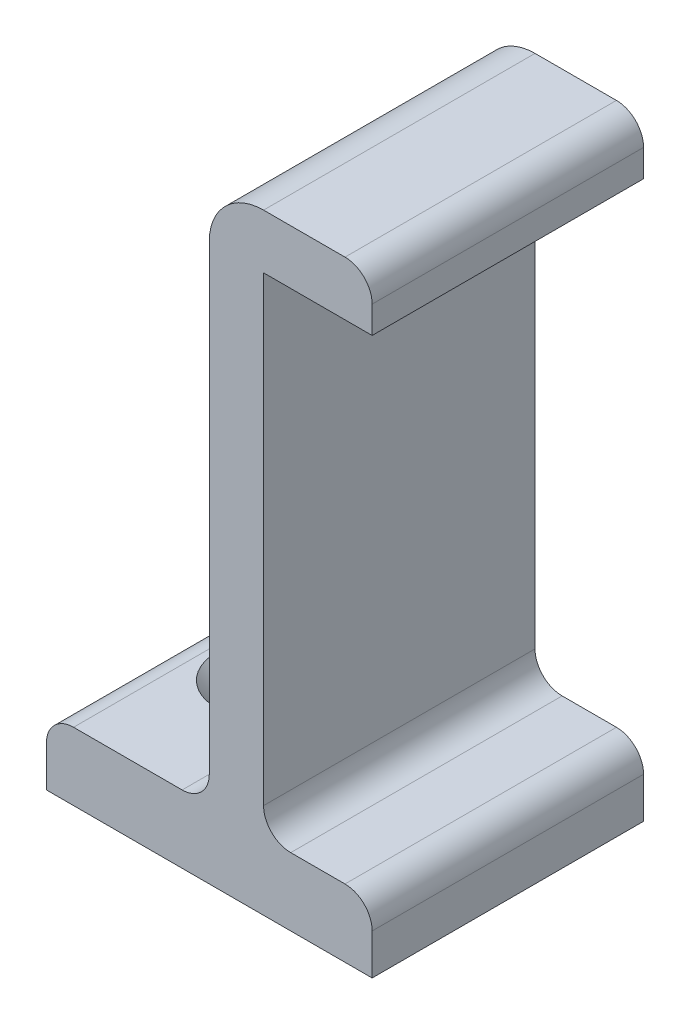
ISO-10303-21;
HEADER;
FILE_DESCRIPTION(('STEP AP214'),'2;1');
FILE_NAME('part.step','',(''),(''),'','','');
FILE_SCHEMA(('AUTOMOTIVE_DESIGN { 1 0 10303 214 1 1 1 1 }'));
ENDSEC;
DATA;
#1=APPLICATION_CONTEXT('core data for automotive mechanical design processes');
#2=APPLICATION_PROTOCOL_DEFINITION('international standard','automotive_design',2000,#1);
#3=PRODUCT_CONTEXT('',#1,'mechanical');
#4=PRODUCT('Part','Part','',(#3));
#5=PRODUCT_RELATED_PRODUCT_CATEGORY('part','',(#4));
#6=PRODUCT_DEFINITION_FORMATION('','',#4);
#7=PRODUCT_DEFINITION_CONTEXT('part definition',#1,'design');
#8=PRODUCT_DEFINITION('design','',#6,#7);
#9=PRODUCT_DEFINITION_SHAPE('','',#8);
#10=(LENGTH_UNIT() NAMED_UNIT(*) SI_UNIT(.MILLI.,.METRE.));
#11=(NAMED_UNIT(*) PLANE_ANGLE_UNIT() SI_UNIT($,.RADIAN.));
#12=(NAMED_UNIT(*) SI_UNIT($,.STERADIAN.) SOLID_ANGLE_UNIT());
#13=UNCERTAINTY_MEASURE_WITH_UNIT(LENGTH_MEASURE(1.E-05),#10,'distance_accuracy_value','');
#14=(GEOMETRIC_REPRESENTATION_CONTEXT(3) GLOBAL_UNCERTAINTY_ASSIGNED_CONTEXT((#13)) GLOBAL_UNIT_ASSIGNED_CONTEXT((#10,
#11,#12)) REPRESENTATION_CONTEXT('',''));
#15=CARTESIAN_POINT('',(0.,0.,0.));
#16=DIRECTION('',(0.,0.,1.));
#17=DIRECTION('',(1.,0.,0.));
#18=AXIS2_PLACEMENT_3D('',#15,#16,#17);
#19=CARTESIAN_POINT('',(-24.,0.,10.));
#20=DIRECTION('',(1.,0.,0.));
#21=DIRECTION('',(0.,0.,-1.));
#22=AXIS2_PLACEMENT_3D('',#19,#20,#21);
#23=PLANE('',#22);
#24=DIRECTION('',(0.,-1.,0.));
#25=VECTOR('',#24,1.);
#26=CARTESIAN_POINT('',(-24.,0.,10.));
#27=LINE('',#26,#25);
#28=CARTESIAN_POINT('',(-24.,3.,10.));
#29=VERTEX_POINT('',#28);
#30=CARTESIAN_POINT('',(-24.,0.,10.));
#31=VERTEX_POINT('',#30);
#32=EDGE_CURVE('E146',#29,#31,#27,.T.);
#33=ORIENTED_EDGE('',*,*,#32,.F.);
#34=DIRECTION('',(0.,0.,-1.));
#35=VECTOR('',#34,1.);
#36=CARTESIAN_POINT('',(-24.,3.,10.));
#37=LINE('',#36,#35);
#38=CARTESIAN_POINT('',(-24.,3.,-10.));
#39=VERTEX_POINT('',#38);
#40=EDGE_CURVE('E202',#29,#39,#37,.T.);
#41=ORIENTED_EDGE('',*,*,#40,.T.);
#42=DIRECTION('',(0.,-1.,0.));
#43=VECTOR('',#42,1.);
#44=CARTESIAN_POINT('',(-24.,0.,-10.));
#45=LINE('',#44,#43);
#46=CARTESIAN_POINT('',(-24.,0.,-10.));
#47=VERTEX_POINT('',#46);
#48=EDGE_CURVE('E171',#39,#47,#45,.T.);
#49=ORIENTED_EDGE('',*,*,#48,.T.);
#50=DIRECTION('',(0.,0.,-1.));
#51=VECTOR('',#50,1.);
#52=CARTESIAN_POINT('',(-24.,0.,10.));
#53=LINE('',#52,#51);
#54=EDGE_CURVE('E164',#31,#47,#53,.T.);
#55=ORIENTED_EDGE('',*,*,#54,.F.);
#56=EDGE_LOOP('',(#33,#41,#49,#55));
#57=FACE_BOUND('',#56,.T.);
#58=ADVANCED_FACE('F34',(#57),#23,.F.);
#59=CARTESIAN_POINT('',(-24.,0.,10.));
#60=DIRECTION('',(0.,1.,0.));
#61=DIRECTION('',(0.,0.,1.));
#62=AXIS2_PLACEMENT_3D('',#59,#60,#61);
#63=PLANE('',#62);
#64=CARTESIAN_POINT('',(-18.,0.,0.));
#65=DIRECTION('',(0.,1.,0.));
#66=DIRECTION('',(-1.,0.,0.));
#67=AXIS2_PLACEMENT_3D('',#64,#65,#66);
#68=CIRCLE('',#67,1.5);
#69=CARTESIAN_POINT('',(-19.5,0.,0.));
#70=VERTEX_POINT('',#69);
#71=EDGE_CURVE('E281',#70,#70,#68,.T.);
#72=ORIENTED_EDGE('',*,*,#71,.T.);
#73=EDGE_LOOP('',(#72));
#74=FACE_BOUND('',#73,.T.);
#75=DIRECTION('',(1.,0.,0.));
#76=VECTOR('',#75,1.);
#77=CARTESIAN_POINT('',(-24.,0.,-10.));
#78=LINE('',#77,#76);
#79=CARTESIAN_POINT('',(0.,0.,-10.));
#80=VERTEX_POINT('',#79);
#81=EDGE_CURVE('E278',#47,#80,#78,.T.);
#82=ORIENTED_EDGE('',*,*,#81,.T.);
#83=DIRECTION('',(0.,0.,-1.));
#84=VECTOR('',#83,1.);
#85=CARTESIAN_POINT('',(0.,0.,10.));
#86=LINE('',#85,#84);
#87=CARTESIAN_POINT('',(0.,0.,10.));
#88=VERTEX_POINT('',#87);
#89=EDGE_CURVE('E166',#88,#80,#86,.T.);
#90=ORIENTED_EDGE('',*,*,#89,.F.);
#91=DIRECTION('',(1.,0.,0.));
#92=VECTOR('',#91,1.);
#93=CARTESIAN_POINT('',(-24.,0.,10.));
#94=LINE('',#93,#92);
#95=EDGE_CURVE('E150',#31,#88,#94,.T.);
#96=ORIENTED_EDGE('',*,*,#95,.F.);
#97=ORIENTED_EDGE('',*,*,#54,.T.);
#98=EDGE_LOOP('',(#82,#90,#96,#97));
#99=FACE_BOUND('',#98,.T.);
#100=ADVANCED_FACE('F163',(#74,#99),#63,.F.);
#101=CARTESIAN_POINT('',(0.,5.,10.));
#102=DIRECTION('',(-1.,0.,0.));
#103=DIRECTION('',(0.,-1.,0.));
#104=AXIS2_PLACEMENT_3D('',#101,#102,#103);
#105=PLANE('',#104);
#106=DIRECTION('',(0.,1.,0.));
#107=VECTOR('',#106,1.);
#108=CARTESIAN_POINT('',(0.,5.,-10.));
#109=LINE('',#108,#107);
#110=CARTESIAN_POINT('',(0.,3.,-10.));
#111=VERTEX_POINT('',#110);
#112=EDGE_CURVE('E275',#80,#111,#109,.T.);
#113=ORIENTED_EDGE('',*,*,#112,.T.);
#114=DIRECTION('',(0.,0.,-1.));
#115=VECTOR('',#114,1.);
#116=CARTESIAN_POINT('',(0.,3.,10.));
#117=LINE('',#116,#115);
#118=CARTESIAN_POINT('',(0.,3.,10.));
#119=VERTEX_POINT('',#118);
#120=EDGE_CURVE('E195',#111,#119,#117,.F.);
#121=ORIENTED_EDGE('',*,*,#120,.T.);
#122=DIRECTION('',(0.,1.,0.));
#123=VECTOR('',#122,1.);
#124=CARTESIAN_POINT('',(0.,5.,10.));
#125=LINE('',#124,#123);
#126=EDGE_CURVE('E168',#88,#119,#125,.T.);
#127=ORIENTED_EDGE('',*,*,#126,.F.);
#128=ORIENTED_EDGE('',*,*,#89,.T.);
#129=EDGE_LOOP('',(#113,#121,#127,#128));
#130=FACE_BOUND('',#129,.T.);
#131=ADVANCED_FACE('F319',(#130),#105,.F.);
#132=CARTESIAN_POINT('',(-8.,5.,10.));
#133=DIRECTION('',(0.,-1.,0.));
#134=DIRECTION('',(0.,0.,-1.));
#135=AXIS2_PLACEMENT_3D('',#132,#133,#134);
#136=PLANE('',#135);
#137=DIRECTION('',(-1.,0.,0.));
#138=VECTOR('',#137,1.);
#139=CARTESIAN_POINT('',(-8.,5.,10.));
#140=LINE('',#139,#138);
#141=CARTESIAN_POINT('',(-2.,5.,10.));
#142=VERTEX_POINT('',#141);
#143=CARTESIAN_POINT('',(-6.,5.,10.));
#144=VERTEX_POINT('',#143);
#145=EDGE_CURVE('E292',#142,#144,#140,.T.);
#146=ORIENTED_EDGE('',*,*,#145,.F.);
#147=DIRECTION('',(0.,0.,-1.));
#148=VECTOR('',#147,1.);
#149=CARTESIAN_POINT('',(-2.,5.,10.));
#150=LINE('',#149,#148);
#151=CARTESIAN_POINT('',(-2.,5.,-10.));
#152=VERTEX_POINT('',#151);
#153=EDGE_CURVE('E186',#142,#152,#150,.T.);
#154=ORIENTED_EDGE('',*,*,#153,.T.);
#155=DIRECTION('',(-1.,0.,0.));
#156=VECTOR('',#155,1.);
#157=CARTESIAN_POINT('',(-8.,5.,-10.));
#158=LINE('',#157,#156);
#159=CARTESIAN_POINT('',(-6.,5.,-10.));
#160=VERTEX_POINT('',#159);
#161=EDGE_CURVE('E270',#152,#160,#158,.T.);
#162=ORIENTED_EDGE('',*,*,#161,.T.);
#163=DIRECTION('',(0.,0.,-1.));
#164=VECTOR('',#163,1.);
#165=CARTESIAN_POINT('',(-6.,5.,10.));
#166=LINE('',#165,#164);
#167=EDGE_CURVE('E184',#160,#144,#166,.F.);
#168=ORIENTED_EDGE('',*,*,#167,.T.);
#169=EDGE_LOOP('',(#146,#154,#162,#168));
#170=FACE_BOUND('',#169,.T.);
#171=ADVANCED_FACE('F357',(#170),#136,.F.);
#172=CARTESIAN_POINT('',(-8.,41.,10.));
#173=DIRECTION('',(-1.,0.,0.));
#174=DIRECTION('',(0.,-1.,0.));
#175=AXIS2_PLACEMENT_3D('',#172,#173,#174);
#176=PLANE('',#175);
#177=DIRECTION('',(0.,1.,0.));
#178=VECTOR('',#177,1.);
#179=CARTESIAN_POINT('',(-8.,41.,10.));
#180=LINE('',#179,#178);
#181=CARTESIAN_POINT('',(-8.,7.,10.));
#182=VERTEX_POINT('',#181);
#183=CARTESIAN_POINT('',(-8.,41.,10.));
#184=VERTEX_POINT('',#183);
#185=EDGE_CURVE('E290',#182,#184,#180,.T.);
#186=ORIENTED_EDGE('',*,*,#185,.F.);
#187=DIRECTION('',(0.,0.,-1.));
#188=VECTOR('',#187,1.);
#189=CARTESIAN_POINT('',(-8.,7.,-10.));
#190=LINE('',#189,#188);
#191=CARTESIAN_POINT('',(-8.,7.,-10.));
#192=VERTEX_POINT('',#191);
#193=EDGE_CURVE('E214',#182,#192,#190,.T.);
#194=ORIENTED_EDGE('',*,*,#193,.T.);
#195=DIRECTION('',(0.,1.,0.));
#196=VECTOR('',#195,1.);
#197=CARTESIAN_POINT('',(-8.,41.,-10.));
#198=LINE('',#197,#196);
#199=CARTESIAN_POINT('',(-8.,41.,-10.));
#200=VERTEX_POINT('',#199);
#201=EDGE_CURVE('E267',#192,#200,#198,.T.);
#202=ORIENTED_EDGE('',*,*,#201,.T.);
#203=DIRECTION('',(0.,0.,-1.));
#204=VECTOR('',#203,1.);
#205=CARTESIAN_POINT('',(-8.,41.,10.));
#206=LINE('',#205,#204);
#207=EDGE_CURVE('E178',#184,#200,#206,.T.);
#208=ORIENTED_EDGE('',*,*,#207,.F.);
#209=EDGE_LOOP('',(#186,#194,#202,#208));
#210=FACE_BOUND('',#209,.T.);
#211=ADVANCED_FACE('F361',(#210),#176,.F.);
#212=CARTESIAN_POINT('',(0.,41.,10.));
#213=DIRECTION('',(0.,1.,0.));
#214=DIRECTION('',(0.,0.,1.));
#215=AXIS2_PLACEMENT_3D('',#212,#213,#214);
#216=PLANE('',#215);
#217=DIRECTION('',(1.,0.,0.));
#218=VECTOR('',#217,1.);
#219=CARTESIAN_POINT('',(0.,41.,-10.));
#220=LINE('',#219,#218);
#221=CARTESIAN_POINT('',(0.,41.,-10.));
#222=VERTEX_POINT('',#221);
#223=EDGE_CURVE('E261',#200,#222,#220,.T.);
#224=ORIENTED_EDGE('',*,*,#223,.T.);
#225=DIRECTION('',(0.,0.,-1.));
#226=VECTOR('',#225,1.);
#227=CARTESIAN_POINT('',(0.,41.,10.));
#228=LINE('',#227,#226);
#229=CARTESIAN_POINT('',(0.,41.,10.));
#230=VERTEX_POINT('',#229);
#231=EDGE_CURVE('E251',#230,#222,#228,.T.);
#232=ORIENTED_EDGE('',*,*,#231,.F.);
#233=DIRECTION('',(1.,0.,0.));
#234=VECTOR('',#233,1.);
#235=CARTESIAN_POINT('',(0.,41.,10.));
#236=LINE('',#235,#234);
#237=EDGE_CURVE('E262',#184,#230,#236,.T.);
#238=ORIENTED_EDGE('',*,*,#237,.F.);
#239=ORIENTED_EDGE('',*,*,#207,.T.);
#240=EDGE_LOOP('',(#224,#232,#238,#239));
#241=FACE_BOUND('',#240,.T.);
#242=ADVANCED_FACE('F259',(#241),#216,.F.);
#243=CARTESIAN_POINT('',(0.,45.,10.));
#244=DIRECTION('',(-1.,0.,0.));
#245=DIRECTION('',(0.,-1.,0.));
#246=AXIS2_PLACEMENT_3D('',#243,#244,#245);
#247=PLANE('',#246);
#248=DIRECTION('',(0.,1.,0.));
#249=VECTOR('',#248,1.);
#250=CARTESIAN_POINT('',(0.,45.,-10.));
#251=LINE('',#250,#249);
#252=CARTESIAN_POINT('',(0.,43.,-10.));
#253=VERTEX_POINT('',#252);
#254=EDGE_CURVE('E247',#222,#253,#251,.T.);
#255=ORIENTED_EDGE('',*,*,#254,.T.);
#256=DIRECTION('',(0.,0.,-1.));
#257=VECTOR('',#256,1.);
#258=CARTESIAN_POINT('',(0.,43.,10.));
#259=LINE('',#258,#257);
#260=CARTESIAN_POINT('',(0.,43.,10.));
#261=VERTEX_POINT('',#260);
#262=EDGE_CURVE('E212',#253,#261,#259,.F.);
#263=ORIENTED_EDGE('',*,*,#262,.T.);
#264=DIRECTION('',(0.,1.,0.));
#265=VECTOR('',#264,1.);
#266=CARTESIAN_POINT('',(0.,45.,10.));
#267=LINE('',#266,#265);
#268=EDGE_CURVE('E286',#230,#261,#267,.T.);
#269=ORIENTED_EDGE('',*,*,#268,.F.);
#270=ORIENTED_EDGE('',*,*,#231,.T.);
#271=EDGE_LOOP('',(#255,#263,#269,#270));
#272=FACE_BOUND('',#271,.T.);
#273=ADVANCED_FACE('F365',(#272),#247,.F.);
#274=CARTESIAN_POINT('',(-12.,45.,10.));
#275=DIRECTION('',(0.,-1.,0.));
#276=DIRECTION('',(0.,0.,-1.));
#277=AXIS2_PLACEMENT_3D('',#274,#275,#276);
#278=PLANE('',#277);
#279=DIRECTION('',(-1.,0.,0.));
#280=VECTOR('',#279,1.);
#281=CARTESIAN_POINT('',(-12.,45.,-10.));
#282=LINE('',#281,#280);
#283=CARTESIAN_POINT('',(-2.00000000000001,45.,-10.));
#284=VERTEX_POINT('',#283);
#285=CARTESIAN_POINT('',(-8.,45.,-10.));
#286=VERTEX_POINT('',#285);
#287=EDGE_CURVE('E243',#284,#286,#282,.T.);
#288=ORIENTED_EDGE('',*,*,#287,.T.);
#289=DIRECTION('',(0.,0.,-1.));
#290=VECTOR('',#289,1.);
#291=CARTESIAN_POINT('',(-8.,45.,10.));
#292=LINE('',#291,#290);
#293=CARTESIAN_POINT('',(-8.,45.,10.));
#294=VERTEX_POINT('',#293);
#295=EDGE_CURVE('E42',#286,#294,#292,.F.);
#296=ORIENTED_EDGE('',*,*,#295,.T.);
#297=DIRECTION('',(-1.,0.,0.));
#298=VECTOR('',#297,1.);
#299=CARTESIAN_POINT('',(-12.,45.,10.));
#300=LINE('',#299,#298);
#301=CARTESIAN_POINT('',(-2.00000000000001,45.,10.));
#302=VERTEX_POINT('',#301);
#303=EDGE_CURVE('E284',#302,#294,#300,.T.);
#304=ORIENTED_EDGE('',*,*,#303,.F.);
#305=DIRECTION('',(0.,0.,-1.));
#306=VECTOR('',#305,1.);
#307=CARTESIAN_POINT('',(-2.00000000000001,45.,10.));
#308=LINE('',#307,#306);
#309=EDGE_CURVE('E209',#302,#284,#308,.T.);
#310=ORIENTED_EDGE('',*,*,#309,.T.);
#311=EDGE_LOOP('',(#288,#296,#304,#310));
#312=FACE_BOUND('',#311,.T.);
#313=ADVANCED_FACE('F368',(#312),#278,.F.);
#314=CARTESIAN_POINT('',(-12.,5.,10.));
#315=DIRECTION('',(1.,0.,0.));
#316=DIRECTION('',(0.,0.,-1.));
#317=AXIS2_PLACEMENT_3D('',#314,#315,#316);
#318=PLANE('',#317);
#319=DIRECTION('',(0.,-1.,0.));
#320=VECTOR('',#319,1.);
#321=CARTESIAN_POINT('',(-12.,5.,10.));
#322=LINE('',#321,#320);
#323=CARTESIAN_POINT('',(-12.,41.,10.));
#324=VERTEX_POINT('',#323);
#325=CARTESIAN_POINT('',(-12.,7.,10.));
#326=VERTEX_POINT('',#325);
#327=EDGE_CURVE('E237',#324,#326,#322,.T.);
#328=ORIENTED_EDGE('',*,*,#327,.F.);
#329=DIRECTION('',(0.,0.,-1.));
#330=VECTOR('',#329,1.);
#331=CARTESIAN_POINT('',(-12.,41.,10.));
#332=LINE('',#331,#330);
#333=CARTESIAN_POINT('',(-12.,41.,-10.));
#334=VERTEX_POINT('',#333);
#335=EDGE_CURVE('E229',#324,#334,#332,.T.);
#336=ORIENTED_EDGE('',*,*,#335,.T.);
#337=DIRECTION('',(0.,-1.,0.));
#338=VECTOR('',#337,1.);
#339=CARTESIAN_POINT('',(-12.,5.,-10.));
#340=LINE('',#339,#338);
#341=CARTESIAN_POINT('',(-12.,7.,-10.));
#342=VERTEX_POINT('',#341);
#343=EDGE_CURVE('E236',#334,#342,#340,.T.);
#344=ORIENTED_EDGE('',*,*,#343,.T.);
#345=DIRECTION('',(0.,0.,-1.));
#346=VECTOR('',#345,1.);
#347=CARTESIAN_POINT('',(-12.,7.,10.));
#348=LINE('',#347,#346);
#349=EDGE_CURVE('E217',#342,#326,#348,.F.);
#350=ORIENTED_EDGE('',*,*,#349,.T.);
#351=EDGE_LOOP('',(#328,#336,#344,#350));
#352=FACE_BOUND('',#351,.T.);
#353=ADVANCED_FACE('F235',(#352),#318,.F.);
#354=CARTESIAN_POINT('',(-24.,5.,10.));
#355=DIRECTION('',(0.,-1.,0.));
#356=DIRECTION('',(1.,0.,0.));
#357=AXIS2_PLACEMENT_3D('',#354,#355,#356);
#358=PLANE('',#357);
#359=CARTESIAN_POINT('',(-18.,5.,0.));
#360=DIRECTION('',(0.,-1.,0.));
#361=DIRECTION('',(1.,0.,0.));
#362=AXIS2_PLACEMENT_3D('',#359,#360,#361);
#363=CIRCLE('',#362,3.50000000000002);
#364=CARTESIAN_POINT('',(-14.5,5.,0.));
#365=VERTEX_POINT('',#364);
#366=EDGE_CURVE('E176',#365,#365,#363,.T.);
#367=ORIENTED_EDGE('',*,*,#366,.T.);
#368=EDGE_LOOP('',(#367));
#369=FACE_BOUND('',#368,.T.);
#370=DIRECTION('',(-1.,0.,0.));
#371=VECTOR('',#370,1.);
#372=CARTESIAN_POINT('',(-24.,5.,-10.));
#373=LINE('',#372,#371);
#374=CARTESIAN_POINT('',(-14.,5.,-10.));
#375=VERTEX_POINT('',#374);
#376=CARTESIAN_POINT('',(-22.,5.,-10.));
#377=VERTEX_POINT('',#376);
#378=EDGE_CURVE('E159',#375,#377,#373,.T.);
#379=ORIENTED_EDGE('',*,*,#378,.T.);
#380=DIRECTION('',(0.,0.,-1.));
#381=VECTOR('',#380,1.);
#382=CARTESIAN_POINT('',(-22.,5.,10.));
#383=LINE('',#382,#381);
#384=CARTESIAN_POINT('',(-22.,5.,10.));
#385=VERTEX_POINT('',#384);
#386=EDGE_CURVE('E207',#377,#385,#383,.F.);
#387=ORIENTED_EDGE('',*,*,#386,.T.);
#388=DIRECTION('',(-1.,0.,0.));
#389=VECTOR('',#388,1.);
#390=CARTESIAN_POINT('',(-24.,5.,10.));
#391=LINE('',#390,#389);
#392=CARTESIAN_POINT('',(-14.,5.,10.));
#393=VERTEX_POINT('',#392);
#394=EDGE_CURVE('E253',#393,#385,#391,.T.);
#395=ORIENTED_EDGE('',*,*,#394,.F.);
#396=DIRECTION('',(0.,0.,-1.));
#397=VECTOR('',#396,1.);
#398=CARTESIAN_POINT('',(-14.,5.,-10.));
#399=LINE('',#398,#397);
#400=EDGE_CURVE('E204',#393,#375,#399,.T.);
#401=ORIENTED_EDGE('',*,*,#400,.T.);
#402=EDGE_LOOP('',(#379,#387,#395,#401));
#403=FACE_BOUND('',#402,.T.);
#404=ADVANCED_FACE('F347',(#369,#403),#358,.F.);
#405=CARTESIAN_POINT('',(0.,0.,10.));
#406=DIRECTION('',(0.,0.,-1.));
#407=DIRECTION('',(-1.,0.,0.));
#408=AXIS2_PLACEMENT_3D('',#405,#406,#407);
#409=PLANE('',#408);
#410=ORIENTED_EDGE('',*,*,#303,.T.);
#411=CARTESIAN_POINT('',(-8.,41.,10.));
#412=DIRECTION('',(0.,0.,-1.));
#413=DIRECTION('',(-1.,0.,0.));
#414=AXIS2_PLACEMENT_3D('',#411,#412,#413);
#415=CIRCLE('',#414,4.);
#416=EDGE_CURVE('E11',#294,#324,#415,.F.);
#417=ORIENTED_EDGE('',*,*,#416,.T.);
#418=ORIENTED_EDGE('',*,*,#327,.T.);
#419=CARTESIAN_POINT('',(-14.,7.,10.));
#420=DIRECTION('',(0.,0.,-1.));
#421=DIRECTION('',(-1.,0.,0.));
#422=AXIS2_PLACEMENT_3D('',#419,#420,#421);
#423=CIRCLE('',#422,2.);
#424=EDGE_CURVE('E227',#326,#393,#423,.T.);
#425=ORIENTED_EDGE('',*,*,#424,.T.);
#426=ORIENTED_EDGE('',*,*,#394,.T.);
#427=CARTESIAN_POINT('',(-22.,3.,10.));
#428=DIRECTION('',(0.,0.,-1.));
#429=DIRECTION('',(-1.,0.,0.));
#430=AXIS2_PLACEMENT_3D('',#427,#428,#429);
#431=CIRCLE('',#430,2.);
#432=EDGE_CURVE('E154',#385,#29,#431,.F.);
#433=ORIENTED_EDGE('',*,*,#432,.T.);
#434=ORIENTED_EDGE('',*,*,#32,.T.);
#435=ORIENTED_EDGE('',*,*,#95,.T.);
#436=ORIENTED_EDGE('',*,*,#126,.T.);
#437=CARTESIAN_POINT('',(-2.,3.,10.));
#438=DIRECTION('',(0.,0.,-1.));
#439=DIRECTION('',(-1.,0.,0.));
#440=AXIS2_PLACEMENT_3D('',#437,#438,#439);
#441=CIRCLE('',#440,2.);
#442=EDGE_CURVE('E200',#119,#142,#441,.F.);
#443=ORIENTED_EDGE('',*,*,#442,.T.);
#444=ORIENTED_EDGE('',*,*,#145,.T.);
#445=CARTESIAN_POINT('',(-6.,7.,10.));
#446=DIRECTION('',(0.,0.,-1.));
#447=DIRECTION('',(-1.,0.,0.));
#448=AXIS2_PLACEMENT_3D('',#445,#446,#447);
#449=CIRCLE('',#448,2.);
#450=EDGE_CURVE('E222',#144,#182,#449,.T.);
#451=ORIENTED_EDGE('',*,*,#450,.T.);
#452=ORIENTED_EDGE('',*,*,#185,.T.);
#453=ORIENTED_EDGE('',*,*,#237,.T.);
#454=ORIENTED_EDGE('',*,*,#268,.T.);
#455=CARTESIAN_POINT('',(-2.00000000000001,43.,10.));
#456=DIRECTION('',(0.,0.,-1.));
#457=DIRECTION('',(-1.,0.,0.));
#458=AXIS2_PLACEMENT_3D('',#455,#456,#457);
#459=CIRCLE('',#458,2.);
#460=EDGE_CURVE('E197',#261,#302,#459,.F.);
#461=ORIENTED_EDGE('',*,*,#460,.T.);
#462=EDGE_LOOP('',(#410,#417,#418,#425,#426,#433,#434,#435,#436,#443,#444,#451,#452,#453,#454,#461));
#463=FACE_BOUND('',#462,.T.);
#464=ADVANCED_FACE('F148',(#463),#409,.F.);
#465=CARTESIAN_POINT('',(0.,0.,-10.));
#466=DIRECTION('',(0.,0.,-1.));
#467=DIRECTION('',(-1.,0.,0.));
#468=AXIS2_PLACEMENT_3D('',#465,#466,#467);
#469=PLANE('',#468);
#470=ORIENTED_EDGE('',*,*,#343,.F.);
#471=CARTESIAN_POINT('',(-8.,41.,-10.));
#472=DIRECTION('',(0.,0.,-1.));
#473=DIRECTION('',(-1.,0.,0.));
#474=AXIS2_PLACEMENT_3D('',#471,#472,#473);
#475=CIRCLE('',#474,4.);
#476=EDGE_CURVE('E56',#334,#286,#475,.T.);
#477=ORIENTED_EDGE('',*,*,#476,.T.);
#478=ORIENTED_EDGE('',*,*,#287,.F.);
#479=CARTESIAN_POINT('',(-2.00000000000001,43.,-10.));
#480=DIRECTION('',(0.,0.,-1.));
#481=DIRECTION('',(-1.,0.,0.));
#482=AXIS2_PLACEMENT_3D('',#479,#480,#481);
#483=CIRCLE('',#482,2.);
#484=EDGE_CURVE('E189',#284,#253,#483,.T.);
#485=ORIENTED_EDGE('',*,*,#484,.T.);
#486=ORIENTED_EDGE('',*,*,#254,.F.);
#487=ORIENTED_EDGE('',*,*,#223,.F.);
#488=ORIENTED_EDGE('',*,*,#201,.F.);
#489=CARTESIAN_POINT('',(-6.,7.,-10.));
#490=DIRECTION('',(0.,0.,-1.));
#491=DIRECTION('',(-1.,0.,0.));
#492=AXIS2_PLACEMENT_3D('',#489,#490,#491);
#493=CIRCLE('',#492,2.);
#494=EDGE_CURVE('E220',#192,#160,#493,.F.);
#495=ORIENTED_EDGE('',*,*,#494,.T.);
#496=ORIENTED_EDGE('',*,*,#161,.F.);
#497=CARTESIAN_POINT('',(-2.,3.,-10.));
#498=DIRECTION('',(0.,0.,-1.));
#499=DIRECTION('',(-1.,0.,0.));
#500=AXIS2_PLACEMENT_3D('',#497,#498,#499);
#501=CIRCLE('',#500,2.);
#502=EDGE_CURVE('E193',#152,#111,#501,.T.);
#503=ORIENTED_EDGE('',*,*,#502,.T.);
#504=ORIENTED_EDGE('',*,*,#112,.F.);
#505=ORIENTED_EDGE('',*,*,#81,.F.);
#506=ORIENTED_EDGE('',*,*,#48,.F.);
#507=CARTESIAN_POINT('',(-22.,3.,-10.));
#508=DIRECTION('',(0.,0.,-1.));
#509=DIRECTION('',(-1.,0.,0.));
#510=AXIS2_PLACEMENT_3D('',#507,#508,#509);
#511=CIRCLE('',#510,2.);
#512=EDGE_CURVE('E191',#39,#377,#511,.T.);
#513=ORIENTED_EDGE('',*,*,#512,.T.);
#514=ORIENTED_EDGE('',*,*,#378,.F.);
#515=CARTESIAN_POINT('',(-14.,7.,-10.));
#516=DIRECTION('',(0.,0.,-1.));
#517=DIRECTION('',(-1.,0.,0.));
#518=AXIS2_PLACEMENT_3D('',#515,#516,#517);
#519=CIRCLE('',#518,2.);
#520=EDGE_CURVE('E224',#375,#342,#519,.F.);
#521=ORIENTED_EDGE('',*,*,#520,.T.);
#522=EDGE_LOOP('',(#470,#477,#478,#485,#486,#487,#488,#495,#496,#503,#504,#505,#506,#513,#514,#521));
#523=FACE_BOUND('',#522,.T.);
#524=ADVANCED_FACE('F240',(#523),#469,.T.);
#525=CARTESIAN_POINT('',(-18.,0.,0.));
#526=DIRECTION('',(0.,1.,0.));
#527=DIRECTION('',(-1.,0.,0.));
#528=AXIS2_PLACEMENT_3D('',#525,#526,#527);
#529=CYLINDRICAL_SURFACE('',#528,1.5);
#530=CARTESIAN_POINT('',(-18.,2.99999999999999,0.));
#531=DIRECTION('',(0.,-1.,0.));
#532=DIRECTION('',(0.,0.,-1.));
#533=AXIS2_PLACEMENT_3D('',#530,#531,#532);
#534=CIRCLE('',#533,1.5);
#535=CARTESIAN_POINT('',(-18.,2.99999999999999,-1.5));
#536=VERTEX_POINT('',#535);
#537=EDGE_CURVE('E173',#536,#536,#534,.F.);
#538=ORIENTED_EDGE('',*,*,#537,.T.);
#539=EDGE_LOOP('',(#538));
#540=FACE_BOUND('',#539,.T.);
#541=ORIENTED_EDGE('',*,*,#71,.F.);
#542=EDGE_LOOP('',(#541));
#543=FACE_BOUND('',#542,.T.);
#544=ADVANCED_FACE('F300',(#540,#543),#529,.F.);
#545=CARTESIAN_POINT('',(-18.,2.99999999999998,0.));
#546=DIRECTION('',(0.,1.,0.));
#547=DIRECTION('',(0.,0.,1.));
#548=AXIS2_PLACEMENT_3D('',#545,#546,#547);
#549=CONICAL_SURFACE('',#548,1.5,0.78539816339745);
#550=ORIENTED_EDGE('',*,*,#366,.F.);
#551=EDGE_LOOP('',(#550));
#552=FACE_BOUND('',#551,.T.);
#553=ORIENTED_EDGE('',*,*,#537,.F.);
#554=EDGE_LOOP('',(#553));
#555=FACE_BOUND('',#554,.T.);
#556=ADVANCED_FACE('F302',(#552,#555),#549,.F.);
#557=CARTESIAN_POINT('',(-2.,3.,10.));
#558=DIRECTION('',(0.,0.,-1.));
#559=DIRECTION('',(-1.,0.,0.));
#560=AXIS2_PLACEMENT_3D('',#557,#558,#559);
#561=CYLINDRICAL_SURFACE('',#560,2.);
#562=ORIENTED_EDGE('',*,*,#442,.F.);
#563=ORIENTED_EDGE('',*,*,#120,.F.);
#564=ORIENTED_EDGE('',*,*,#502,.F.);
#565=ORIENTED_EDGE('',*,*,#153,.F.);
#566=EDGE_LOOP('',(#562,#563,#564,#565));
#567=FACE_BOUND('',#566,.T.);
#568=ADVANCED_FACE('F309',(#567),#561,.T.);
#569=CARTESIAN_POINT('',(-22.,3.,10.));
#570=DIRECTION('',(0.,0.,-1.));
#571=DIRECTION('',(-1.,0.,0.));
#572=AXIS2_PLACEMENT_3D('',#569,#570,#571);
#573=CYLINDRICAL_SURFACE('',#572,2.);
#574=ORIENTED_EDGE('',*,*,#432,.F.);
#575=ORIENTED_EDGE('',*,*,#386,.F.);
#576=ORIENTED_EDGE('',*,*,#512,.F.);
#577=ORIENTED_EDGE('',*,*,#40,.F.);
#578=EDGE_LOOP('',(#574,#575,#576,#577));
#579=FACE_BOUND('',#578,.T.);
#580=ADVANCED_FACE('F325',(#579),#573,.T.);
#581=CARTESIAN_POINT('',(-2.00000000000001,43.,10.));
#582=DIRECTION('',(0.,0.,-1.));
#583=DIRECTION('',(-1.,0.,0.));
#584=AXIS2_PLACEMENT_3D('',#581,#582,#583);
#585=CYLINDRICAL_SURFACE('',#584,2.);
#586=ORIENTED_EDGE('',*,*,#460,.F.);
#587=ORIENTED_EDGE('',*,*,#262,.F.);
#588=ORIENTED_EDGE('',*,*,#484,.F.);
#589=ORIENTED_EDGE('',*,*,#309,.F.);
#590=EDGE_LOOP('',(#586,#587,#588,#589));
#591=FACE_BOUND('',#590,.T.);
#592=ADVANCED_FACE('F329',(#591),#585,.T.);
#593=CARTESIAN_POINT('',(-6.,7.,10.));
#594=DIRECTION('',(0.,0.,1.));
#595=DIRECTION('',(1.,0.,0.));
#596=AXIS2_PLACEMENT_3D('',#593,#594,#595);
#597=CYLINDRICAL_SURFACE('',#596,2.);
#598=ORIENTED_EDGE('',*,*,#450,.F.);
#599=ORIENTED_EDGE('',*,*,#167,.F.);
#600=ORIENTED_EDGE('',*,*,#494,.F.);
#601=ORIENTED_EDGE('',*,*,#193,.F.);
#602=EDGE_LOOP('',(#598,#599,#600,#601));
#603=FACE_BOUND('',#602,.T.);
#604=ADVANCED_FACE('F333',(#603),#597,.F.);
#605=CARTESIAN_POINT('',(-14.,7.,10.));
#606=DIRECTION('',(0.,0.,1.));
#607=DIRECTION('',(1.,0.,0.));
#608=AXIS2_PLACEMENT_3D('',#605,#606,#607);
#609=CYLINDRICAL_SURFACE('',#608,2.);
#610=ORIENTED_EDGE('',*,*,#424,.F.);
#611=ORIENTED_EDGE('',*,*,#349,.F.);
#612=ORIENTED_EDGE('',*,*,#520,.F.);
#613=ORIENTED_EDGE('',*,*,#400,.F.);
#614=EDGE_LOOP('',(#610,#611,#612,#613));
#615=FACE_BOUND('',#614,.T.);
#616=ADVANCED_FACE('F336',(#615),#609,.F.);
#617=CARTESIAN_POINT('',(-8.,41.,10.));
#618=DIRECTION('',(0.,0.,-1.));
#619=DIRECTION('',(-1.,0.,0.));
#620=AXIS2_PLACEMENT_3D('',#617,#618,#619);
#621=CYLINDRICAL_SURFACE('',#620,4.);
#622=ORIENTED_EDGE('',*,*,#416,.F.);
#623=ORIENTED_EDGE('',*,*,#295,.F.);
#624=ORIENTED_EDGE('',*,*,#476,.F.);
#625=ORIENTED_EDGE('',*,*,#335,.F.);
#626=EDGE_LOOP('',(#622,#623,#624,#625));
#627=FACE_BOUND('',#626,.T.);
#628=ADVANCED_FACE('F36',(#627),#621,.T.);
#629=CLOSED_SHELL('',(#58,#100,#131,#171,#211,#242,#273,#313,#353,#404,#464,#524,#544,#556,#568,
#580,#592,#604,#616,#628));
#630=MANIFOLD_SOLID_BREP('B2',#629);
#631=ADVANCED_BREP_SHAPE_REPRESENTATION('',(#18,#630),#14);
#632=SHAPE_DEFINITION_REPRESENTATION(#9,#631);
ENDSEC;
END-ISO-10303-21;
